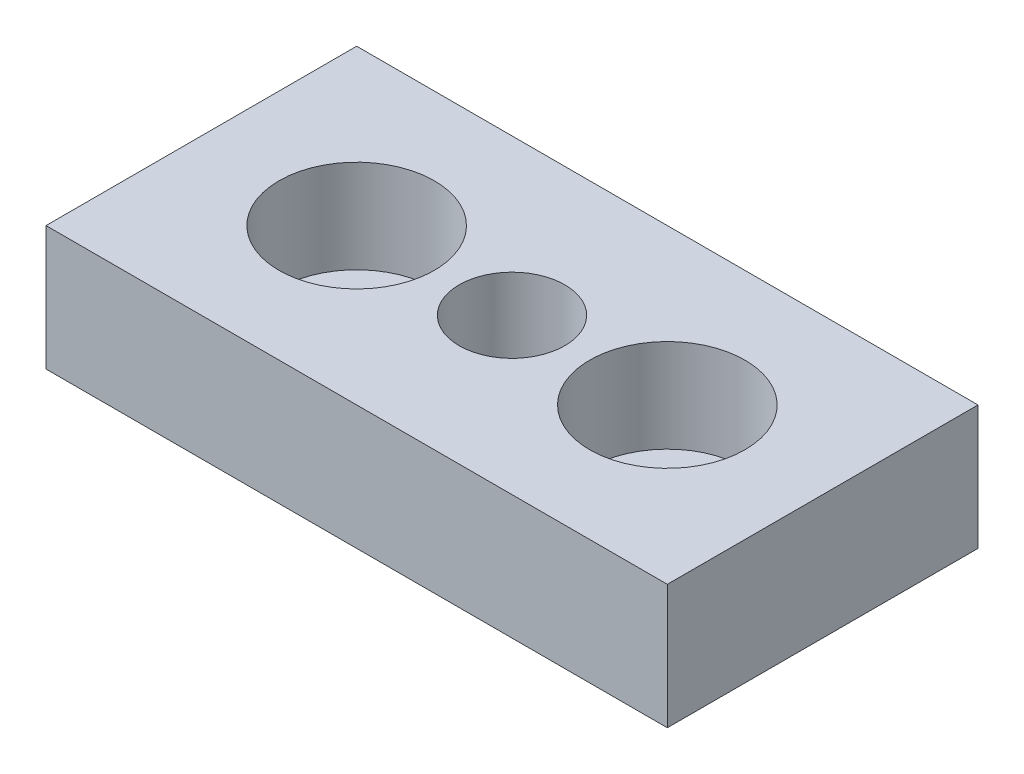
ISO-10303-21;
HEADER;
FILE_DESCRIPTION(('STEP AP214'),'2;1');
FILE_NAME('part.step','',(''),(''),'','','');
FILE_SCHEMA(('AUTOMOTIVE_DESIGN { 1 0 10303 214 1 1 1 1 }'));
ENDSEC;
DATA;
#1=APPLICATION_CONTEXT('core data for automotive mechanical design processes');
#2=APPLICATION_PROTOCOL_DEFINITION('international standard','automotive_design',2000,#1);
#3=PRODUCT_CONTEXT('',#1,'mechanical');
#4=PRODUCT('Part','Part','',(#3));
#5=PRODUCT_RELATED_PRODUCT_CATEGORY('part','',(#4));
#6=PRODUCT_DEFINITION_FORMATION('','',#4);
#7=PRODUCT_DEFINITION_CONTEXT('part definition',#1,'design');
#8=PRODUCT_DEFINITION('design','',#6,#7);
#9=PRODUCT_DEFINITION_SHAPE('','',#8);
#10=(LENGTH_UNIT() NAMED_UNIT(*) SI_UNIT(.MILLI.,.METRE.));
#11=(NAMED_UNIT(*) PLANE_ANGLE_UNIT() SI_UNIT($,.RADIAN.));
#12=(NAMED_UNIT(*) SI_UNIT($,.STERADIAN.) SOLID_ANGLE_UNIT());
#13=UNCERTAINTY_MEASURE_WITH_UNIT(LENGTH_MEASURE(1.E-05),#10,'distance_accuracy_value','');
#14=(GEOMETRIC_REPRESENTATION_CONTEXT(3) GLOBAL_UNCERTAINTY_ASSIGNED_CONTEXT((#13)) GLOBAL_UNIT_ASSIGNED_CONTEXT((#10,
#11,#12)) REPRESENTATION_CONTEXT('',''));
#15=CARTESIAN_POINT('',(0.,0.,0.));
#16=DIRECTION('',(0.,0.,1.));
#17=DIRECTION('',(1.,0.,0.));
#18=AXIS2_PLACEMENT_3D('',#15,#16,#17);
#19=CARTESIAN_POINT('',(30.,12.,15.));
#20=DIRECTION('',(-1.,0.,0.));
#21=DIRECTION('',(0.,0.,1.));
#22=AXIS2_PLACEMENT_3D('',#19,#20,#21);
#23=PLANE('',#22);
#24=DIRECTION('',(0.,0.,-1.));
#25=VECTOR('',#24,1.);
#26=CARTESIAN_POINT('',(30.,0.,15.));
#27=LINE('',#26,#25);
#28=CARTESIAN_POINT('',(30.,0.,15.));
#29=VERTEX_POINT('',#28);
#30=CARTESIAN_POINT('',(30.,0.,-15.));
#31=VERTEX_POINT('',#30);
#32=EDGE_CURVE('E100',#29,#31,#27,.T.);
#33=ORIENTED_EDGE('',*,*,#32,.T.);
#34=DIRECTION('',(0.,-1.,0.));
#35=VECTOR('',#34,1.);
#36=CARTESIAN_POINT('',(30.,12.,-15.));
#37=LINE('',#36,#35);
#38=CARTESIAN_POINT('',(30.,12.,-15.));
#39=VERTEX_POINT('',#38);
#40=EDGE_CURVE('E11',#39,#31,#37,.T.);
#41=ORIENTED_EDGE('',*,*,#40,.F.);
#42=DIRECTION('',(0.,0.,-1.));
#43=VECTOR('',#42,1.);
#44=CARTESIAN_POINT('',(30.,12.,15.));
#45=LINE('',#44,#43);
#46=CARTESIAN_POINT('',(30.,12.,15.));
#47=VERTEX_POINT('',#46);
#48=EDGE_CURVE('E88',#47,#39,#45,.T.);
#49=ORIENTED_EDGE('',*,*,#48,.F.);
#50=DIRECTION('',(0.,-1.,0.));
#51=VECTOR('',#50,1.);
#52=CARTESIAN_POINT('',(30.,12.,15.));
#53=LINE('',#52,#51);
#54=EDGE_CURVE('E96',#47,#29,#53,.T.);
#55=ORIENTED_EDGE('',*,*,#54,.T.);
#56=EDGE_LOOP('',(#33,#41,#49,#55));
#57=FACE_BOUND('',#56,.T.);
#58=ADVANCED_FACE('F37',(#57),#23,.F.);
#59=CARTESIAN_POINT('',(-30.,12.,-15.));
#60=DIRECTION('',(0.,0.,1.));
#61=DIRECTION('',(1.,0.,0.));
#62=AXIS2_PLACEMENT_3D('',#59,#60,#61);
#63=PLANE('',#62);
#64=DIRECTION('',(-1.,0.,0.));
#65=VECTOR('',#64,1.);
#66=CARTESIAN_POINT('',(-30.,0.,-15.));
#67=LINE('',#66,#65);
#68=CARTESIAN_POINT('',(-30.,0.,-15.));
#69=VERTEX_POINT('',#68);
#70=EDGE_CURVE('E92',#31,#69,#67,.T.);
#71=ORIENTED_EDGE('',*,*,#70,.T.);
#72=DIRECTION('',(0.,-1.,0.));
#73=VECTOR('',#72,1.);
#74=CARTESIAN_POINT('',(-30.,12.,-15.));
#75=LINE('',#74,#73);
#76=CARTESIAN_POINT('',(-30.,12.,-15.));
#77=VERTEX_POINT('',#76);
#78=EDGE_CURVE('E45',#77,#69,#75,.T.);
#79=ORIENTED_EDGE('',*,*,#78,.F.);
#80=DIRECTION('',(-1.,0.,0.));
#81=VECTOR('',#80,1.);
#82=CARTESIAN_POINT('',(-30.,12.,-15.));
#83=LINE('',#82,#81);
#84=EDGE_CURVE('E83',#39,#77,#83,.T.);
#85=ORIENTED_EDGE('',*,*,#84,.F.);
#86=ORIENTED_EDGE('',*,*,#40,.T.);
#87=EDGE_LOOP('',(#71,#79,#85,#86));
#88=FACE_BOUND('',#87,.T.);
#89=ADVANCED_FACE('F91',(#88),#63,.F.);
#90=CARTESIAN_POINT('',(-30.,12.,15.));
#91=DIRECTION('',(1.,0.,0.));
#92=DIRECTION('',(0.,0.,-1.));
#93=AXIS2_PLACEMENT_3D('',#90,#91,#92);
#94=PLANE('',#93);
#95=DIRECTION('',(0.,0.,1.));
#96=VECTOR('',#95,1.);
#97=CARTESIAN_POINT('',(-30.,0.,15.));
#98=LINE('',#97,#96);
#99=CARTESIAN_POINT('',(-30.,0.,15.));
#100=VERTEX_POINT('',#99);
#101=EDGE_CURVE('E70',#69,#100,#98,.T.);
#102=ORIENTED_EDGE('',*,*,#101,.T.);
#103=DIRECTION('',(0.,-1.,0.));
#104=VECTOR('',#103,1.);
#105=CARTESIAN_POINT('',(-30.,12.,15.));
#106=LINE('',#105,#104);
#107=CARTESIAN_POINT('',(-30.,12.,15.));
#108=VERTEX_POINT('',#107);
#109=EDGE_CURVE('E93',#108,#100,#106,.T.);
#110=ORIENTED_EDGE('',*,*,#109,.F.);
#111=DIRECTION('',(0.,0.,1.));
#112=VECTOR('',#111,1.);
#113=CARTESIAN_POINT('',(-30.,12.,15.));
#114=LINE('',#113,#112);
#115=EDGE_CURVE('E86',#77,#108,#114,.T.);
#116=ORIENTED_EDGE('',*,*,#115,.F.);
#117=ORIENTED_EDGE('',*,*,#78,.T.);
#118=EDGE_LOOP('',(#102,#110,#116,#117));
#119=FACE_BOUND('',#118,.T.);
#120=ADVANCED_FACE('F94',(#119),#94,.F.);
#121=CARTESIAN_POINT('',(-30.,12.,15.));
#122=DIRECTION('',(0.,0.,-1.));
#123=DIRECTION('',(-1.,0.,0.));
#124=AXIS2_PLACEMENT_3D('',#121,#122,#123);
#125=PLANE('',#124);
#126=DIRECTION('',(1.,0.,0.));
#127=VECTOR('',#126,1.);
#128=CARTESIAN_POINT('',(-30.,0.,15.));
#129=LINE('',#128,#127);
#130=EDGE_CURVE('E76',#100,#29,#129,.T.);
#131=ORIENTED_EDGE('',*,*,#130,.T.);
#132=ORIENTED_EDGE('',*,*,#54,.F.);
#133=DIRECTION('',(1.,0.,0.));
#134=VECTOR('',#133,1.);
#135=CARTESIAN_POINT('',(-30.,12.,15.));
#136=LINE('',#135,#134);
#137=EDGE_CURVE('E53',#108,#47,#136,.T.);
#138=ORIENTED_EDGE('',*,*,#137,.F.);
#139=ORIENTED_EDGE('',*,*,#109,.T.);
#140=EDGE_LOOP('',(#131,#132,#138,#139));
#141=FACE_BOUND('',#140,.T.);
#142=ADVANCED_FACE('F108',(#141),#125,.F.);
#143=CARTESIAN_POINT('',(0.,12.,0.));
#144=DIRECTION('',(0.,-1.,0.));
#145=DIRECTION('',(0.,0.,-1.));
#146=AXIS2_PLACEMENT_3D('',#143,#144,#145);
#147=PLANE('',#146);
#148=CARTESIAN_POINT('',(0.,12.,0.));
#149=DIRECTION('',(0.,1.,0.));
#150=DIRECTION('',(0.,0.,1.));
#151=AXIS2_PLACEMENT_3D('',#148,#149,#150);
#152=CIRCLE('',#151,5.1);
#153=CARTESIAN_POINT('',(0.,12.,5.1));
#154=VERTEX_POINT('',#153);
#155=EDGE_CURVE('E140',#154,#154,#152,.T.);
#156=ORIENTED_EDGE('',*,*,#155,.F.);
#157=EDGE_LOOP('',(#156));
#158=FACE_BOUND('',#157,.T.);
#159=CARTESIAN_POINT('',(15.,12.,0.));
#160=DIRECTION('',(0.,-1.,0.));
#161=DIRECTION('',(1.,0.,0.));
#162=AXIS2_PLACEMENT_3D('',#159,#160,#161);
#163=CIRCLE('',#162,7.5);
#164=CARTESIAN_POINT('',(22.5,12.,0.));
#165=VERTEX_POINT('',#164);
#166=EDGE_CURVE('E125',#165,#165,#163,.T.);
#167=ORIENTED_EDGE('',*,*,#166,.T.);
#168=EDGE_LOOP('',(#167));
#169=FACE_BOUND('',#168,.T.);
#170=CARTESIAN_POINT('',(-15.,12.,0.));
#171=DIRECTION('',(0.,1.,0.));
#172=DIRECTION('',(-1.,0.,0.));
#173=AXIS2_PLACEMENT_3D('',#170,#171,#172);
#174=CIRCLE('',#173,7.5);
#175=CARTESIAN_POINT('',(-22.5,12.,0.));
#176=VERTEX_POINT('',#175);
#177=EDGE_CURVE('E103',#176,#176,#174,.T.);
#178=ORIENTED_EDGE('',*,*,#177,.F.);
#179=EDGE_LOOP('',(#178));
#180=FACE_BOUND('',#179,.T.);
#181=ORIENTED_EDGE('',*,*,#48,.T.);
#182=ORIENTED_EDGE('',*,*,#84,.T.);
#183=ORIENTED_EDGE('',*,*,#115,.T.);
#184=ORIENTED_EDGE('',*,*,#137,.T.);
#185=EDGE_LOOP('',(#181,#182,#183,#184));
#186=FACE_BOUND('',#185,.T.);
#187=ADVANCED_FACE('F84',(#158,#169,#180,#186),#147,.F.);
#188=CARTESIAN_POINT('',(0.,0.,0.));
#189=DIRECTION('',(0.,-1.,0.));
#190=DIRECTION('',(0.,0.,-1.));
#191=AXIS2_PLACEMENT_3D('',#188,#189,#190);
#192=PLANE('',#191);
#193=CARTESIAN_POINT('',(0.,0.,0.));
#194=DIRECTION('',(0.,-1.,0.));
#195=DIRECTION('',(0.,0.,-1.));
#196=AXIS2_PLACEMENT_3D('',#193,#194,#195);
#197=CIRCLE('',#196,5.1);
#198=CARTESIAN_POINT('',(0.,0.,-5.1));
#199=VERTEX_POINT('',#198);
#200=EDGE_CURVE('E137',#199,#199,#197,.T.);
#201=ORIENTED_EDGE('',*,*,#200,.F.);
#202=EDGE_LOOP('',(#201));
#203=FACE_BOUND('',#202,.T.);
#204=CARTESIAN_POINT('',(15.,0.,0.));
#205=DIRECTION('',(0.,-1.,0.));
#206=DIRECTION('',(1.,0.,0.));
#207=AXIS2_PLACEMENT_3D('',#204,#205,#206);
#208=CIRCLE('',#207,4.5);
#209=CARTESIAN_POINT('',(19.5,0.,0.));
#210=VERTEX_POINT('',#209);
#211=EDGE_CURVE('E134',#210,#210,#208,.T.);
#212=ORIENTED_EDGE('',*,*,#211,.F.);
#213=EDGE_LOOP('',(#212));
#214=FACE_BOUND('',#213,.T.);
#215=CARTESIAN_POINT('',(-15.,0.,0.));
#216=DIRECTION('',(0.,1.,0.));
#217=DIRECTION('',(-1.,0.,0.));
#218=AXIS2_PLACEMENT_3D('',#215,#216,#217);
#219=CIRCLE('',#218,4.5);
#220=CARTESIAN_POINT('',(-19.5,0.,0.));
#221=VERTEX_POINT('',#220);
#222=EDGE_CURVE('E122',#221,#221,#219,.T.);
#223=ORIENTED_EDGE('',*,*,#222,.T.);
#224=EDGE_LOOP('',(#223));
#225=FACE_BOUND('',#224,.T.);
#226=ORIENTED_EDGE('',*,*,#32,.F.);
#227=ORIENTED_EDGE('',*,*,#130,.F.);
#228=ORIENTED_EDGE('',*,*,#101,.F.);
#229=ORIENTED_EDGE('',*,*,#70,.F.);
#230=EDGE_LOOP('',(#226,#227,#228,#229));
#231=FACE_BOUND('',#230,.T.);
#232=ADVANCED_FACE('F111',(#203,#214,#225,#231),#192,.T.);
#233=CARTESIAN_POINT('',(-15.,12.,0.));
#234=DIRECTION('',(0.,1.,0.));
#235=DIRECTION('',(-1.,0.,0.));
#236=AXIS2_PLACEMENT_3D('',#233,#234,#235);
#237=CYLINDRICAL_SURFACE('',#236,7.5);
#238=CARTESIAN_POINT('',(-15.,3.,0.));
#239=DIRECTION('',(0.,1.,0.));
#240=DIRECTION('',(-1.,0.,0.));
#241=AXIS2_PLACEMENT_3D('',#238,#239,#240);
#242=CIRCLE('',#241,7.5);
#243=CARTESIAN_POINT('',(-22.5,3.,0.));
#244=VERTEX_POINT('',#243);
#245=EDGE_CURVE('E116',#244,#244,#242,.T.);
#246=ORIENTED_EDGE('',*,*,#245,.F.);
#247=EDGE_LOOP('',(#246));
#248=FACE_BOUND('',#247,.T.);
#249=ORIENTED_EDGE('',*,*,#177,.T.);
#250=EDGE_LOOP('',(#249));
#251=FACE_BOUND('',#250,.T.);
#252=ADVANCED_FACE('F154',(#248,#251),#237,.F.);
#253=CARTESIAN_POINT('',(-22.5,3.,0.));
#254=DIRECTION('',(0.,-1.,0.));
#255=DIRECTION('',(1.,0.,0.));
#256=AXIS2_PLACEMENT_3D('',#253,#254,#255);
#257=PLANE('',#256);
#258=CARTESIAN_POINT('',(-15.,3.,0.));
#259=DIRECTION('',(0.,1.,0.));
#260=DIRECTION('',(-1.,0.,0.));
#261=AXIS2_PLACEMENT_3D('',#258,#259,#260);
#262=CIRCLE('',#261,4.5);
#263=CARTESIAN_POINT('',(-19.5,3.,0.));
#264=VERTEX_POINT('',#263);
#265=EDGE_CURVE('E119',#264,#264,#262,.T.);
#266=ORIENTED_EDGE('',*,*,#265,.F.);
#267=EDGE_LOOP('',(#266));
#268=FACE_BOUND('',#267,.T.);
#269=ORIENTED_EDGE('',*,*,#245,.T.);
#270=EDGE_LOOP('',(#269));
#271=FACE_BOUND('',#270,.T.);
#272=ADVANCED_FACE('F156',(#268,#271),#257,.F.);
#273=CARTESIAN_POINT('',(-15.,12.,0.));
#274=DIRECTION('',(0.,1.,0.));
#275=DIRECTION('',(-1.,0.,0.));
#276=AXIS2_PLACEMENT_3D('',#273,#274,#275);
#277=CYLINDRICAL_SURFACE('',#276,4.5);
#278=ORIENTED_EDGE('',*,*,#222,.F.);
#279=EDGE_LOOP('',(#278));
#280=FACE_BOUND('',#279,.T.);
#281=ORIENTED_EDGE('',*,*,#265,.T.);
#282=EDGE_LOOP('',(#281));
#283=FACE_BOUND('',#282,.T.);
#284=ADVANCED_FACE('F163',(#280,#283),#277,.F.);
#285=CARTESIAN_POINT('',(15.,12.,0.));
#286=DIRECTION('',(0.,1.,0.));
#287=DIRECTION('',(1.,0.,0.));
#288=AXIS2_PLACEMENT_3D('',#285,#286,#287);
#289=CYLINDRICAL_SURFACE('',#288,7.5);
#290=CARTESIAN_POINT('',(15.,3.,0.));
#291=DIRECTION('',(0.,-1.,0.));
#292=DIRECTION('',(1.,0.,0.));
#293=AXIS2_PLACEMENT_3D('',#290,#291,#292);
#294=CIRCLE('',#293,7.5);
#295=CARTESIAN_POINT('',(22.5,3.,0.));
#296=VERTEX_POINT('',#295);
#297=EDGE_CURVE('E128',#296,#296,#294,.T.);
#298=ORIENTED_EDGE('',*,*,#297,.T.);
#299=EDGE_LOOP('',(#298));
#300=FACE_BOUND('',#299,.T.);
#301=ORIENTED_EDGE('',*,*,#166,.F.);
#302=EDGE_LOOP('',(#301));
#303=FACE_BOUND('',#302,.T.);
#304=ADVANCED_FACE('F219',(#300,#303),#289,.F.);
#305=CARTESIAN_POINT('',(22.5,3.,0.));
#306=DIRECTION('',(0.,-1.,0.));
#307=DIRECTION('',(-1.,0.,0.));
#308=AXIS2_PLACEMENT_3D('',#305,#306,#307);
#309=PLANE('',#308);
#310=CARTESIAN_POINT('',(15.,3.,0.));
#311=DIRECTION('',(0.,-1.,0.));
#312=DIRECTION('',(1.,0.,0.));
#313=AXIS2_PLACEMENT_3D('',#310,#311,#312);
#314=CIRCLE('',#313,4.5);
#315=CARTESIAN_POINT('',(19.5,3.,0.));
#316=VERTEX_POINT('',#315);
#317=EDGE_CURVE('E131',#316,#316,#314,.T.);
#318=ORIENTED_EDGE('',*,*,#317,.T.);
#319=EDGE_LOOP('',(#318));
#320=FACE_BOUND('',#319,.T.);
#321=ORIENTED_EDGE('',*,*,#297,.F.);
#322=EDGE_LOOP('',(#321));
#323=FACE_BOUND('',#322,.T.);
#324=ADVANCED_FACE('F212',(#320,#323),#309,.F.);
#325=CARTESIAN_POINT('',(15.,12.,0.));
#326=DIRECTION('',(0.,1.,0.));
#327=DIRECTION('',(1.,0.,0.));
#328=AXIS2_PLACEMENT_3D('',#325,#326,#327);
#329=CYLINDRICAL_SURFACE('',#328,4.5);
#330=ORIENTED_EDGE('',*,*,#211,.T.);
#331=EDGE_LOOP('',(#330));
#332=FACE_BOUND('',#331,.T.);
#333=ORIENTED_EDGE('',*,*,#317,.F.);
#334=EDGE_LOOP('',(#333));
#335=FACE_BOUND('',#334,.T.);
#336=ADVANCED_FACE('F202',(#332,#335),#329,.F.);
#337=CARTESIAN_POINT('',(0.,12.,0.));
#338=DIRECTION('',(0.,1.,0.));
#339=DIRECTION('',(0.,0.,1.));
#340=AXIS2_PLACEMENT_3D('',#337,#338,#339);
#341=CYLINDRICAL_SURFACE('',#340,5.1);
#342=ORIENTED_EDGE('',*,*,#155,.T.);
#343=EDGE_LOOP('',(#342));
#344=FACE_BOUND('',#343,.T.);
#345=ORIENTED_EDGE('',*,*,#200,.T.);
#346=EDGE_LOOP('',(#345));
#347=FACE_BOUND('',#346,.T.);
#348=ADVANCED_FACE('F144',(#344,#347),#341,.F.);
#349=CLOSED_SHELL('',(#58,#89,#120,#142,#187,#232,#252,#272,#284,#304,#324,#336,#348));
#350=MANIFOLD_SOLID_BREP('B2',#349);
#351=ADVANCED_BREP_SHAPE_REPRESENTATION('',(#18,#350),#14);
#352=SHAPE_DEFINITION_REPRESENTATION(#9,#351);
ENDSEC;
END-ISO-10303-21;
